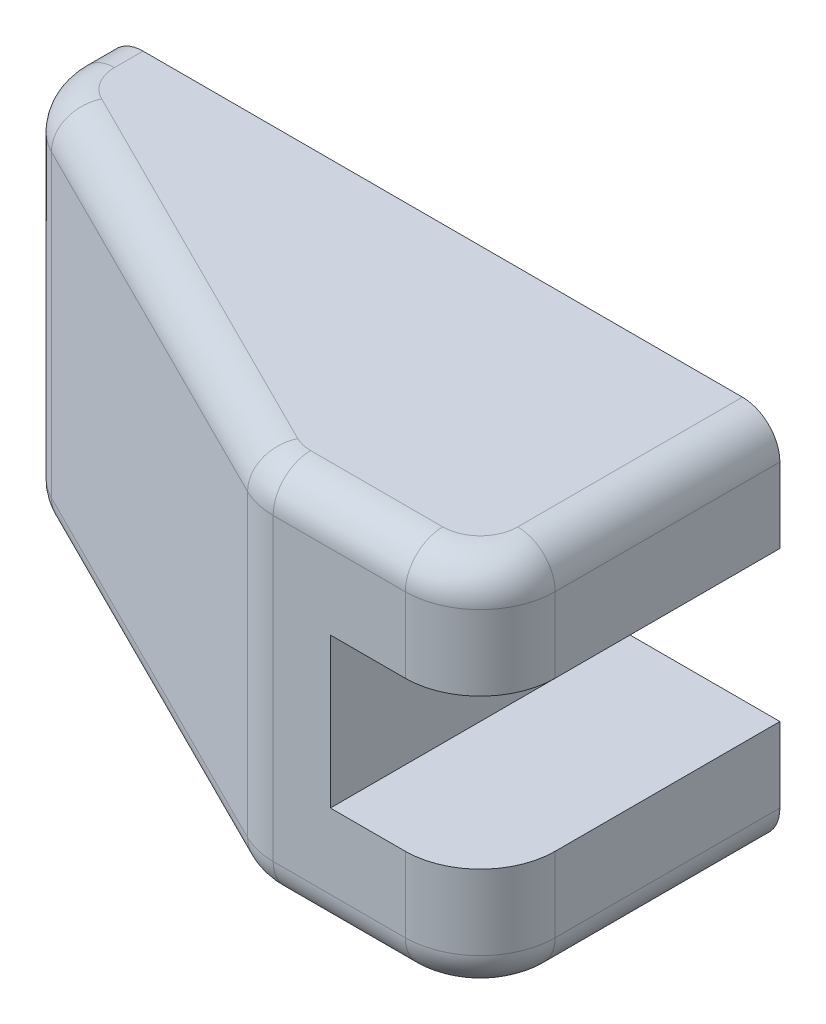
ISO-10303-21;
HEADER;
FILE_DESCRIPTION(('STEP AP214'),'2;1');
FILE_NAME('part.step','',(''),(''),'','','');
FILE_SCHEMA(('AUTOMOTIVE_DESIGN { 1 0 10303 214 1 1 1 1 }'));
ENDSEC;
DATA;
#1=APPLICATION_CONTEXT('core data for automotive mechanical design processes');
#2=APPLICATION_PROTOCOL_DEFINITION('international standard','automotive_design',2000,#1);
#3=PRODUCT_CONTEXT('',#1,'mechanical');
#4=PRODUCT('Part','Part','',(#3));
#5=PRODUCT_RELATED_PRODUCT_CATEGORY('part','',(#4));
#6=PRODUCT_DEFINITION_FORMATION('','',#4);
#7=PRODUCT_DEFINITION_CONTEXT('part definition',#1,'design');
#8=PRODUCT_DEFINITION('design','',#6,#7);
#9=PRODUCT_DEFINITION_SHAPE('','',#8);
#10=(LENGTH_UNIT() NAMED_UNIT(*) SI_UNIT(.MILLI.,.METRE.));
#11=(NAMED_UNIT(*) PLANE_ANGLE_UNIT() SI_UNIT($,.RADIAN.));
#12=(NAMED_UNIT(*) SI_UNIT($,.STERADIAN.) SOLID_ANGLE_UNIT());
#13=UNCERTAINTY_MEASURE_WITH_UNIT(LENGTH_MEASURE(1.E-05),#10,'distance_accuracy_value','');
#14=(GEOMETRIC_REPRESENTATION_CONTEXT(3) GLOBAL_UNCERTAINTY_ASSIGNED_CONTEXT((#13)) GLOBAL_UNIT_ASSIGNED_CONTEXT((#10,
#11,#12)) REPRESENTATION_CONTEXT('',''));
#15=CARTESIAN_POINT('',(0.,0.,0.));
#16=DIRECTION('',(0.,0.,1.));
#17=DIRECTION('',(1.,0.,0.));
#18=AXIS2_PLACEMENT_3D('',#15,#16,#17);
#19=CARTESIAN_POINT('',(-652.,0.,40.));
#20=DIRECTION('',(-1.,0.,0.));
#21=DIRECTION('',(0.,0.,-1.));
#22=AXIS2_PLACEMENT_3D('',#19,#20,#21);
#23=PLANE('',#22);
#24=DIRECTION('',(0.,-1.,0.));
#25=VECTOR('',#24,1.);
#26=CARTESIAN_POINT('',(-652.,0.,0.));
#27=LINE('',#26,#25);
#28=CARTESIAN_POINT('',(-652.,420.,0.));
#29=VERTEX_POINT('',#28);
#30=CARTESIAN_POINT('',(-652.,380.,0.));
#31=VERTEX_POINT('',#30);
#32=EDGE_CURVE('E214',#29,#31,#27,.T.);
#33=ORIENTED_EDGE('',*,*,#32,.T.);
#34=DIRECTION('',(0.,0.,-1.));
#35=VECTOR('',#34,1.);
#36=CARTESIAN_POINT('',(-652.,380.,3.81966011250102));
#37=LINE('',#36,#35);
#38=CARTESIAN_POINT('',(-652.,380.,3.81966011250102));
#39=VERTEX_POINT('',#38);
#40=EDGE_CURVE('E299',#31,#39,#37,.F.);
#41=ORIENTED_EDGE('',*,*,#40,.T.);
#42=DIRECTION('',(0.,1.,0.));
#43=VECTOR('',#42,1.);
#44=CARTESIAN_POINT('',(-652.,0.,3.81966011250102));
#45=LINE('',#44,#43);
#46=CARTESIAN_POINT('',(-652.,420.,3.81966011250102));
#47=VERTEX_POINT('',#46);
#48=EDGE_CURVE('E249',#39,#47,#45,.T.);
#49=ORIENTED_EDGE('',*,*,#48,.T.);
#50=DIRECTION('',(0.,0.,-1.));
#51=VECTOR('',#50,1.);
#52=CARTESIAN_POINT('',(-652.,420.,40.));
#53=LINE('',#52,#51);
#54=EDGE_CURVE('E296',#47,#29,#53,.T.);
#55=ORIENTED_EDGE('',*,*,#54,.T.);
#56=EDGE_LOOP('',(#33,#41,#49,#55));
#57=FACE_BOUND('',#56,.T.);
#58=ADVANCED_FACE('F38',(#57),#23,.T.);
#59=CARTESIAN_POINT('',(0.,425.,40.));
#60=DIRECTION('',(0.,1.,0.));
#61=DIRECTION('',(0.,0.,-1.));
#62=AXIS2_PLACEMENT_3D('',#59,#60,#61);
#63=PLANE('',#62);
#64=DIRECTION('',(-1.,0.,0.));
#65=VECTOR('',#64,1.);
#66=CARTESIAN_POINT('',(0.,425.,0.));
#67=LINE('',#66,#65);
#68=CARTESIAN_POINT('',(-567.,425.,0.));
#69=VERTEX_POINT('',#68);
#70=CARTESIAN_POINT('',(-647.,425.,0.));
#71=VERTEX_POINT('',#70);
#72=EDGE_CURVE('E195',#69,#71,#67,.T.);
#73=ORIENTED_EDGE('',*,*,#72,.T.);
#74=DIRECTION('',(0.,0.,-1.));
#75=VECTOR('',#74,1.);
#76=CARTESIAN_POINT('',(-647.,425.,40.));
#77=LINE('',#76,#75);
#78=CARTESIAN_POINT('',(-647.,425.,3.81966011250102));
#79=VERTEX_POINT('',#78);
#80=EDGE_CURVE('E63',#71,#79,#77,.F.);
#81=ORIENTED_EDGE('',*,*,#80,.T.);
#82=CARTESIAN_POINT('',(-642.,425.,3.81966011250102));
#83=DIRECTION('',(0.,1.,0.));
#84=DIRECTION('',(0.,0.,1.));
#85=AXIS2_PLACEMENT_3D('',#82,#83,#84);
#86=CIRCLE('',#85,5.);
#87=CARTESIAN_POINT('',(-644.2360679775,425.,8.2917960675006));
#88=VERTEX_POINT('',#87);
#89=EDGE_CURVE('E315',#79,#88,#86,.T.);
#90=ORIENTED_EDGE('',*,*,#89,.T.);
#91=DIRECTION('',(0.894427190999917,0.,0.447213595499956));
#92=VECTOR('',#91,1.);
#93=CARTESIAN_POINT('',(-116.163932022499,425.,272.327864045));
#94=LINE('',#93,#92);
#95=CARTESIAN_POINT('',(-591.875388202502,425.,34.4721359549996));
#96=VERTEX_POINT('',#95);
#97=EDGE_CURVE('E305',#88,#96,#94,.T.);
#98=ORIENTED_EDGE('',*,*,#97,.T.);
#99=CARTESIAN_POINT('',(-589.639320225002,425.,30.));
#100=DIRECTION('',(0.,1.,0.));
#101=DIRECTION('',(0.,0.,1.));
#102=AXIS2_PLACEMENT_3D('',#99,#100,#101);
#103=CIRCLE('',#102,5.);
#104=CARTESIAN_POINT('',(-589.639320225002,425.,35.));
#105=VERTEX_POINT('',#104);
#106=EDGE_CURVE('E307',#96,#105,#103,.T.);
#107=ORIENTED_EDGE('',*,*,#106,.T.);
#108=DIRECTION('',(-1.,0.,0.));
#109=VECTOR('',#108,1.);
#110=CARTESIAN_POINT('',(-572.,425.,35.));
#111=LINE('',#110,#109);
#112=CARTESIAN_POINT('',(-572.,425.,35.));
#113=VERTEX_POINT('',#112);
#114=EDGE_CURVE('E309',#105,#113,#111,.F.);
#115=ORIENTED_EDGE('',*,*,#114,.T.);
#116=CARTESIAN_POINT('',(-572.,425.,30.));
#117=DIRECTION('',(0.,1.,0.));
#118=DIRECTION('',(0.,0.,1.));
#119=AXIS2_PLACEMENT_3D('',#116,#117,#118);
#120=CIRCLE('',#119,5.);
#121=CARTESIAN_POINT('',(-567.,425.,30.));
#122=VERTEX_POINT('',#121);
#123=EDGE_CURVE('E311',#113,#122,#120,.T.);
#124=ORIENTED_EDGE('',*,*,#123,.T.);
#125=DIRECTION('',(0.,0.,-1.));
#126=VECTOR('',#125,1.);
#127=CARTESIAN_POINT('',(-567.,425.,40.));
#128=LINE('',#127,#126);
#129=EDGE_CURVE('E313',#122,#69,#128,.T.);
#130=ORIENTED_EDGE('',*,*,#129,.T.);
#131=EDGE_LOOP('',(#73,#81,#90,#98,#107,#115,#124,#130));
#132=FACE_BOUND('',#131,.T.);
#133=ADVANCED_FACE('F366',(#132),#63,.T.);
#134=CARTESIAN_POINT('',(-562.,0.,40.));
#135=DIRECTION('',(1.,0.,0.));
#136=DIRECTION('',(0.,0.,1.));
#137=AXIS2_PLACEMENT_3D('',#134,#135,#136);
#138=PLANE('',#137);
#139=DIRECTION('',(0.,1.,0.));
#140=VECTOR('',#139,1.);
#141=CARTESIAN_POINT('',(-562.,0.,0.));
#142=LINE('',#141,#140);
#143=CARTESIAN_POINT('',(-562.,410.,0.));
#144=VERTEX_POINT('',#143);
#145=CARTESIAN_POINT('',(-562.,420.,0.));
#146=VERTEX_POINT('',#145);
#147=EDGE_CURVE('E230',#144,#146,#142,.T.);
#148=ORIENTED_EDGE('',*,*,#147,.T.);
#149=DIRECTION('',(0.,0.,-1.));
#150=VECTOR('',#149,1.);
#151=CARTESIAN_POINT('',(-562.,420.,40.));
#152=LINE('',#151,#150);
#153=CARTESIAN_POINT('',(-562.,420.,30.));
#154=VERTEX_POINT('',#153);
#155=EDGE_CURVE('E55',#146,#154,#152,.F.);
#156=ORIENTED_EDGE('',*,*,#155,.T.);
#157=DIRECTION('',(0.,1.,0.));
#158=VECTOR('',#157,1.);
#159=CARTESIAN_POINT('',(-562.,410.,30.));
#160=LINE('',#159,#158);
#161=CARTESIAN_POINT('',(-562.,410.,30.));
#162=VERTEX_POINT('',#161);
#163=EDGE_CURVE('E257',#154,#162,#160,.F.);
#164=ORIENTED_EDGE('',*,*,#163,.T.);
#165=DIRECTION('',(0.,0.,-1.));
#166=VECTOR('',#165,1.);
#167=CARTESIAN_POINT('',(-562.,410.,40.));
#168=LINE('',#167,#166);
#169=EDGE_CURVE('E233',#162,#144,#168,.T.);
#170=ORIENTED_EDGE('',*,*,#169,.T.);
#171=EDGE_LOOP('',(#148,#156,#164,#170));
#172=FACE_BOUND('',#171,.T.);
#173=ADVANCED_FACE('F428',(#172),#138,.T.);
#174=CARTESIAN_POINT('',(0.,410.,40.));
#175=DIRECTION('',(0.,-1.,0.));
#176=DIRECTION('',(0.,0.,1.));
#177=AXIS2_PLACEMENT_3D('',#174,#175,#176);
#178=PLANE('',#177);
#179=ORIENTED_EDGE('',*,*,#169,.F.);
#180=CARTESIAN_POINT('',(-572.,410.,30.));
#181=DIRECTION('',(0.,-1.,0.));
#182=DIRECTION('',(0.,0.,-1.));
#183=AXIS2_PLACEMENT_3D('',#180,#181,#182);
#184=CIRCLE('',#183,10.);
#185=CARTESIAN_POINT('',(-572.,410.,40.));
#186=VERTEX_POINT('',#185);
#187=EDGE_CURVE('E259',#162,#186,#184,.T.);
#188=ORIENTED_EDGE('',*,*,#187,.T.);
#189=DIRECTION('',(1.,0.,0.));
#190=VECTOR('',#189,1.);
#191=CARTESIAN_POINT('',(0.,410.,40.));
#192=LINE('',#191,#190);
#193=CARTESIAN_POINT('',(-582.,410.,40.));
#194=VERTEX_POINT('',#193);
#195=EDGE_CURVE('E210',#194,#186,#192,.T.);
#196=ORIENTED_EDGE('',*,*,#195,.F.);
#197=DIRECTION('',(0.,0.,-1.));
#198=VECTOR('',#197,1.);
#199=CARTESIAN_POINT('',(-582.,410.,40.));
#200=LINE('',#199,#198);
#201=CARTESIAN_POINT('',(-582.,410.,0.));
#202=VERTEX_POINT('',#201);
#203=EDGE_CURVE('E204',#194,#202,#200,.T.);
#204=ORIENTED_EDGE('',*,*,#203,.T.);
#205=DIRECTION('',(1.,0.,0.));
#206=VECTOR('',#205,1.);
#207=CARTESIAN_POINT('',(0.,410.,0.));
#208=LINE('',#207,#206);
#209=EDGE_CURVE('E227',#202,#144,#208,.T.);
#210=ORIENTED_EDGE('',*,*,#209,.T.);
#211=EDGE_LOOP('',(#179,#188,#196,#204,#210));
#212=FACE_BOUND('',#211,.T.);
#213=ADVANCED_FACE('F424',(#212),#178,.T.);
#214=CARTESIAN_POINT('',(-582.,0.,40.));
#215=DIRECTION('',(1.,0.,0.));
#216=DIRECTION('',(0.,0.,1.));
#217=AXIS2_PLACEMENT_3D('',#214,#215,#216);
#218=PLANE('',#217);
#219=DIRECTION('',(0.,1.,0.));
#220=VECTOR('',#219,1.);
#221=CARTESIAN_POINT('',(-582.,0.,0.));
#222=LINE('',#221,#220);
#223=CARTESIAN_POINT('',(-582.,390.,0.));
#224=VERTEX_POINT('',#223);
#225=EDGE_CURVE('E225',#224,#202,#222,.T.);
#226=ORIENTED_EDGE('',*,*,#225,.T.);
#227=ORIENTED_EDGE('',*,*,#203,.F.);
#228=DIRECTION('',(0.,1.,0.));
#229=VECTOR('',#228,1.);
#230=CARTESIAN_POINT('',(-582.,0.,40.));
#231=LINE('',#230,#229);
#232=CARTESIAN_POINT('',(-582.,390.,40.));
#233=VERTEX_POINT('',#232);
#234=EDGE_CURVE('E189',#233,#194,#231,.T.);
#235=ORIENTED_EDGE('',*,*,#234,.F.);
#236=DIRECTION('',(0.,0.,-1.));
#237=VECTOR('',#236,1.);
#238=CARTESIAN_POINT('',(-582.,390.,40.));
#239=LINE('',#238,#237);
#240=EDGE_CURVE('E198',#233,#224,#239,.T.);
#241=ORIENTED_EDGE('',*,*,#240,.T.);
#242=EDGE_LOOP('',(#226,#227,#235,#241));
#243=FACE_BOUND('',#242,.T.);
#244=ADVANCED_FACE('F207',(#243),#218,.T.);
#245=CARTESIAN_POINT('',(0.,390.,40.));
#246=DIRECTION('',(0.,-1.,0.));
#247=DIRECTION('',(0.,0.,1.));
#248=AXIS2_PLACEMENT_3D('',#245,#246,#247);
#249=PLANE('',#248);
#250=DIRECTION('',(1.,0.,0.));
#251=VECTOR('',#250,1.);
#252=CARTESIAN_POINT('',(0.,390.,40.));
#253=LINE('',#252,#251);
#254=CARTESIAN_POINT('',(-572.,390.,40.));
#255=VERTEX_POINT('',#254);
#256=EDGE_CURVE('E183',#233,#255,#253,.T.);
#257=ORIENTED_EDGE('',*,*,#256,.T.);
#258=CARTESIAN_POINT('',(-572.,390.,30.));
#259=DIRECTION('',(0.,-1.,0.));
#260=DIRECTION('',(0.,0.,-1.));
#261=AXIS2_PLACEMENT_3D('',#258,#259,#260);
#262=CIRCLE('',#261,10.);
#263=CARTESIAN_POINT('',(-562.,390.,30.));
#264=VERTEX_POINT('',#263);
#265=EDGE_CURVE('E255',#255,#264,#262,.F.);
#266=ORIENTED_EDGE('',*,*,#265,.T.);
#267=DIRECTION('',(0.,0.,-1.));
#268=VECTOR('',#267,1.);
#269=CARTESIAN_POINT('',(-562.,390.,40.));
#270=LINE('',#269,#268);
#271=CARTESIAN_POINT('',(-562.,390.,0.));
#272=VERTEX_POINT('',#271);
#273=EDGE_CURVE('E205',#264,#272,#270,.T.);
#274=ORIENTED_EDGE('',*,*,#273,.T.);
#275=DIRECTION('',(1.,0.,0.));
#276=VECTOR('',#275,1.);
#277=CARTESIAN_POINT('',(0.,390.,0.));
#278=LINE('',#277,#276);
#279=EDGE_CURVE('E201',#224,#272,#278,.T.);
#280=ORIENTED_EDGE('',*,*,#279,.F.);
#281=ORIENTED_EDGE('',*,*,#240,.F.);
#282=EDGE_LOOP('',(#257,#266,#274,#280,#281));
#283=FACE_BOUND('',#282,.T.);
#284=ADVANCED_FACE('F199',(#283),#249,.F.);
#285=CARTESIAN_POINT('',(-562.,0.,40.));
#286=DIRECTION('',(-1.,0.,0.));
#287=DIRECTION('',(0.,0.,-1.));
#288=AXIS2_PLACEMENT_3D('',#285,#286,#287);
#289=PLANE('',#288);
#290=DIRECTION('',(0.,-1.,0.));
#291=VECTOR('',#290,1.);
#292=CARTESIAN_POINT('',(-562.,0.,30.));
#293=LINE('',#292,#291);
#294=CARTESIAN_POINT('',(-562.,380.,30.));
#295=VERTEX_POINT('',#294);
#296=EDGE_CURVE('E252',#264,#295,#293,.T.);
#297=ORIENTED_EDGE('',*,*,#296,.T.);
#298=DIRECTION('',(0.,0.,-1.));
#299=VECTOR('',#298,1.);
#300=CARTESIAN_POINT('',(-562.,380.,40.));
#301=LINE('',#300,#299);
#302=CARTESIAN_POINT('',(-562.,380.,0.));
#303=VERTEX_POINT('',#302);
#304=EDGE_CURVE('E261',#295,#303,#301,.T.);
#305=ORIENTED_EDGE('',*,*,#304,.T.);
#306=DIRECTION('',(0.,-1.,0.));
#307=VECTOR('',#306,1.);
#308=CARTESIAN_POINT('',(-562.,0.,0.));
#309=LINE('',#308,#307);
#310=EDGE_CURVE('E221',#272,#303,#309,.T.);
#311=ORIENTED_EDGE('',*,*,#310,.F.);
#312=ORIENTED_EDGE('',*,*,#273,.F.);
#313=EDGE_LOOP('',(#297,#305,#311,#312));
#314=FACE_BOUND('',#313,.T.);
#315=ADVANCED_FACE('F418',(#314),#289,.F.);
#316=CARTESIAN_POINT('',(0.,375.,40.));
#317=DIRECTION('',(0.,1.,0.));
#318=DIRECTION('',(0.,0.,-1.));
#319=AXIS2_PLACEMENT_3D('',#316,#317,#318);
#320=PLANE('',#319);
#321=DIRECTION('',(-1.,0.,0.));
#322=VECTOR('',#321,1.);
#323=CARTESIAN_POINT('',(0.,375.,0.));
#324=LINE('',#323,#322);
#325=CARTESIAN_POINT('',(-567.,375.,0.));
#326=VERTEX_POINT('',#325);
#327=CARTESIAN_POINT('',(-647.,375.,0.));
#328=VERTEX_POINT('',#327);
#329=EDGE_CURVE('E217',#326,#328,#324,.T.);
#330=ORIENTED_EDGE('',*,*,#329,.F.);
#331=DIRECTION('',(0.,0.,-1.));
#332=VECTOR('',#331,1.);
#333=CARTESIAN_POINT('',(-567.,375.,40.));
#334=LINE('',#333,#332);
#335=CARTESIAN_POINT('',(-567.,375.,30.));
#336=VERTEX_POINT('',#335);
#337=EDGE_CURVE('E284',#326,#336,#334,.F.);
#338=ORIENTED_EDGE('',*,*,#337,.T.);
#339=CARTESIAN_POINT('',(-572.,375.,30.));
#340=DIRECTION('',(0.,1.,0.));
#341=DIRECTION('',(0.,0.,1.));
#342=AXIS2_PLACEMENT_3D('',#339,#340,#341);
#343=CIRCLE('',#342,5.);
#344=CARTESIAN_POINT('',(-572.,375.,35.));
#345=VERTEX_POINT('',#344);
#346=EDGE_CURVE('E282',#336,#345,#343,.F.);
#347=ORIENTED_EDGE('',*,*,#346,.T.);
#348=DIRECTION('',(-1.,0.,0.));
#349=VECTOR('',#348,1.);
#350=CARTESIAN_POINT('',(0.,375.,35.));
#351=LINE('',#350,#349);
#352=CARTESIAN_POINT('',(-589.639320225002,375.,35.));
#353=VERTEX_POINT('',#352);
#354=EDGE_CURVE('E280',#345,#353,#351,.T.);
#355=ORIENTED_EDGE('',*,*,#354,.T.);
#356=CARTESIAN_POINT('',(-589.639320225002,375.,30.));
#357=DIRECTION('',(0.,1.,0.));
#358=DIRECTION('',(0.,0.,1.));
#359=AXIS2_PLACEMENT_3D('',#356,#357,#358);
#360=CIRCLE('',#359,5.);
#361=CARTESIAN_POINT('',(-591.875388202502,375.,34.4721359549996));
#362=VERTEX_POINT('',#361);
#363=EDGE_CURVE('E278',#353,#362,#360,.F.);
#364=ORIENTED_EDGE('',*,*,#363,.T.);
#365=DIRECTION('',(-0.894427190999917,0.,-0.447213595499956));
#366=VECTOR('',#365,1.);
#367=CARTESIAN_POINT('',(-644.2360679775,375.,8.29179606750052));
#368=LINE('',#367,#366);
#369=CARTESIAN_POINT('',(-644.2360679775,375.,8.29179606750059));
#370=VERTEX_POINT('',#369);
#371=EDGE_CURVE('E272',#362,#370,#368,.T.);
#372=ORIENTED_EDGE('',*,*,#371,.T.);
#373=CARTESIAN_POINT('',(-642.,375.,3.81966011250102));
#374=DIRECTION('',(0.,1.,0.));
#375=DIRECTION('',(0.,0.,1.));
#376=AXIS2_PLACEMENT_3D('',#373,#374,#375);
#377=CIRCLE('',#376,5.);
#378=CARTESIAN_POINT('',(-647.,375.,3.81966011250102));
#379=VERTEX_POINT('',#378);
#380=EDGE_CURVE('E274',#370,#379,#377,.F.);
#381=ORIENTED_EDGE('',*,*,#380,.T.);
#382=DIRECTION('',(0.,0.,-1.));
#383=VECTOR('',#382,1.);
#384=CARTESIAN_POINT('',(-647.,375.,0.));
#385=LINE('',#384,#383);
#386=EDGE_CURVE('E276',#379,#328,#385,.T.);
#387=ORIENTED_EDGE('',*,*,#386,.T.);
#388=EDGE_LOOP('',(#330,#338,#347,#355,#364,#372,#381,#387));
#389=FACE_BOUND('',#388,.T.);
#390=ADVANCED_FACE('F443',(#389),#320,.F.);
#391=CARTESIAN_POINT('',(0.,0.,40.));
#392=DIRECTION('',(0.,0.,-1.));
#393=DIRECTION('',(1.,0.,0.));
#394=AXIS2_PLACEMENT_3D('',#391,#392,#393);
#395=PLANE('',#394);
#396=DIRECTION('',(0.,-1.,0.));
#397=VECTOR('',#396,1.);
#398=CARTESIAN_POINT('',(-589.639320225002,375.,40.));
#399=LINE('',#398,#397);
#400=CARTESIAN_POINT('',(-589.639320225002,420.,40.));
#401=VERTEX_POINT('',#400);
#402=CARTESIAN_POINT('',(-589.639320225002,380.,40.));
#403=VERTEX_POINT('',#402);
#404=EDGE_CURVE('E241',#401,#403,#399,.T.);
#405=ORIENTED_EDGE('',*,*,#404,.T.);
#406=DIRECTION('',(-1.,0.,0.));
#407=VECTOR('',#406,1.);
#408=CARTESIAN_POINT('',(0.,380.,40.));
#409=LINE('',#408,#407);
#410=CARTESIAN_POINT('',(-572.,380.,40.));
#411=VERTEX_POINT('',#410);
#412=EDGE_CURVE('E290',#403,#411,#409,.F.);
#413=ORIENTED_EDGE('',*,*,#412,.T.);
#414=DIRECTION('',(0.,-1.,0.));
#415=VECTOR('',#414,1.);
#416=CARTESIAN_POINT('',(-572.,0.,40.));
#417=LINE('',#416,#415);
#418=EDGE_CURVE('E192',#411,#255,#417,.F.);
#419=ORIENTED_EDGE('',*,*,#418,.T.);
#420=ORIENTED_EDGE('',*,*,#256,.F.);
#421=ORIENTED_EDGE('',*,*,#234,.T.);
#422=ORIENTED_EDGE('',*,*,#195,.T.);
#423=DIRECTION('',(0.,1.,0.));
#424=VECTOR('',#423,1.);
#425=CARTESIAN_POINT('',(-572.,425.,40.));
#426=LINE('',#425,#424);
#427=CARTESIAN_POINT('',(-572.,420.,40.));
#428=VERTEX_POINT('',#427);
#429=EDGE_CURVE('E235',#186,#428,#426,.T.);
#430=ORIENTED_EDGE('',*,*,#429,.T.);
#431=DIRECTION('',(-1.,0.,0.));
#432=VECTOR('',#431,1.);
#433=CARTESIAN_POINT('',(-589.639320225002,420.,40.));
#434=LINE('',#433,#432);
#435=EDGE_CURVE('E288',#428,#401,#434,.T.);
#436=ORIENTED_EDGE('',*,*,#435,.T.);
#437=EDGE_LOOP('',(#405,#413,#419,#420,#421,#422,#430,#436));
#438=FACE_BOUND('',#437,.T.);
#439=ADVANCED_FACE('F186',(#438),#395,.F.);
#440=CARTESIAN_POINT('',(0.,0.,0.));
#441=DIRECTION('',(0.,0.,-1.));
#442=DIRECTION('',(1.,0.,0.));
#443=AXIS2_PLACEMENT_3D('',#440,#441,#442);
#444=PLANE('',#443);
#445=ORIENTED_EDGE('',*,*,#310,.T.);
#446=CARTESIAN_POINT('',(-567.,380.,0.));
#447=DIRECTION('',(0.,0.,-1.));
#448=DIRECTION('',(-1.,0.,0.));
#449=AXIS2_PLACEMENT_3D('',#446,#447,#448);
#450=CIRCLE('',#449,5.);
#451=EDGE_CURVE('E270',#303,#326,#450,.T.);
#452=ORIENTED_EDGE('',*,*,#451,.T.);
#453=ORIENTED_EDGE('',*,*,#329,.T.);
#454=CARTESIAN_POINT('',(-647.,380.,0.));
#455=DIRECTION('',(0.,0.,-1.));
#456=DIRECTION('',(-1.,0.,0.));
#457=AXIS2_PLACEMENT_3D('',#454,#455,#456);
#458=CIRCLE('',#457,5.);
#459=EDGE_CURVE('E268',#328,#31,#458,.T.);
#460=ORIENTED_EDGE('',*,*,#459,.T.);
#461=ORIENTED_EDGE('',*,*,#32,.F.);
#462=CARTESIAN_POINT('',(-647.,420.,0.));
#463=DIRECTION('',(0.,0.,-1.));
#464=DIRECTION('',(-1.,0.,0.));
#465=AXIS2_PLACEMENT_3D('',#462,#463,#464);
#466=CIRCLE('',#465,5.);
#467=EDGE_CURVE('E266',#29,#71,#466,.T.);
#468=ORIENTED_EDGE('',*,*,#467,.T.);
#469=ORIENTED_EDGE('',*,*,#72,.F.);
#470=CARTESIAN_POINT('',(-567.,420.,0.));
#471=DIRECTION('',(0.,0.,-1.));
#472=DIRECTION('',(-1.,0.,0.));
#473=AXIS2_PLACEMENT_3D('',#470,#471,#472);
#474=CIRCLE('',#473,5.);
#475=EDGE_CURVE('E264',#69,#146,#474,.T.);
#476=ORIENTED_EDGE('',*,*,#475,.T.);
#477=ORIENTED_EDGE('',*,*,#147,.F.);
#478=ORIENTED_EDGE('',*,*,#209,.F.);
#479=ORIENTED_EDGE('',*,*,#225,.F.);
#480=ORIENTED_EDGE('',*,*,#279,.T.);
#481=EDGE_LOOP('',(#445,#452,#453,#460,#461,#468,#469,#476,#477,#478,#479,#480));
#482=FACE_BOUND('',#481,.T.);
#483=ADVANCED_FACE('F368',(#482),#444,.T.);
#484=CARTESIAN_POINT('',(-592.,0.,40.));
#485=DIRECTION('',(-0.447213595499956,0.,0.894427190999917));
#486=DIRECTION('',(0.,1.,0.));
#487=AXIS2_PLACEMENT_3D('',#484,#485,#486);
#488=PLANE('',#487);
#489=DIRECTION('',(0.,1.,0.));
#490=VECTOR('',#489,1.);
#491=CARTESIAN_POINT('',(-646.472135955,0.,12.7639320225002));
#492=LINE('',#491,#490);
#493=CARTESIAN_POINT('',(-646.472135955,420.,12.7639320225002));
#494=VERTEX_POINT('',#493);
#495=CARTESIAN_POINT('',(-646.472135955,380.,12.7639320225002));
#496=VERTEX_POINT('',#495);
#497=EDGE_CURVE('E243',#494,#496,#492,.F.);
#498=ORIENTED_EDGE('',*,*,#497,.T.);
#499=DIRECTION('',(-0.894427190999917,0.,-0.447213595499956));
#500=VECTOR('',#499,1.);
#501=CARTESIAN_POINT('',(-594.111456180001,380.,38.9442719099991));
#502=LINE('',#501,#500);
#503=CARTESIAN_POINT('',(-594.111456180001,380.,38.9442719099992));
#504=VERTEX_POINT('',#503);
#505=EDGE_CURVE('E11',#496,#504,#502,.F.);
#506=ORIENTED_EDGE('',*,*,#505,.T.);
#507=DIRECTION('',(0.,-1.,0.));
#508=VECTOR('',#507,1.);
#509=CARTESIAN_POINT('',(-594.111456180001,425.,38.9442719099992));
#510=LINE('',#509,#508);
#511=CARTESIAN_POINT('',(-594.111456180001,420.,38.9442719099992));
#512=VERTEX_POINT('',#511);
#513=EDGE_CURVE('E246',#504,#512,#510,.F.);
#514=ORIENTED_EDGE('',*,*,#513,.T.);
#515=DIRECTION('',(0.894427190999917,0.,0.447213595499956));
#516=VECTOR('',#515,1.);
#517=CARTESIAN_POINT('',(-592.,420.,40.));
#518=LINE('',#517,#516);
#519=EDGE_CURVE('E47',#512,#494,#518,.F.);
#520=ORIENTED_EDGE('',*,*,#519,.T.);
#521=EDGE_LOOP('',(#498,#506,#514,#520));
#522=FACE_BOUND('',#521,.T.);
#523=ADVANCED_FACE('F446',(#522),#488,.T.);
#524=CARTESIAN_POINT('',(-589.639320225002,0.,30.));
#525=DIRECTION('',(0.,1.,0.));
#526=DIRECTION('',(0.,0.,1.));
#527=AXIS2_PLACEMENT_3D('',#524,#525,#526);
#528=CYLINDRICAL_SURFACE('',#527,10.);
#529=ORIENTED_EDGE('',*,*,#513,.F.);
#530=CARTESIAN_POINT('',(-589.639320225002,380.,30.));
#531=DIRECTION('',(0.,1.,0.));
#532=DIRECTION('',(0.,0.,1.));
#533=AXIS2_PLACEMENT_3D('',#530,#531,#532);
#534=CIRCLE('',#533,10.);
#535=EDGE_CURVE('E294',#504,#403,#534,.T.);
#536=ORIENTED_EDGE('',*,*,#535,.T.);
#537=ORIENTED_EDGE('',*,*,#404,.F.);
#538=CARTESIAN_POINT('',(-589.639320225002,420.,30.));
#539=DIRECTION('',(0.,1.,0.));
#540=DIRECTION('',(0.,0.,1.));
#541=AXIS2_PLACEMENT_3D('',#538,#539,#540);
#542=CIRCLE('',#541,10.);
#543=EDGE_CURVE('E292',#401,#512,#542,.F.);
#544=ORIENTED_EDGE('',*,*,#543,.T.);
#545=EDGE_LOOP('',(#529,#536,#537,#544));
#546=FACE_BOUND('',#545,.T.);
#547=ADVANCED_FACE('F400',(#546),#528,.T.);
#548=CARTESIAN_POINT('',(-642.,0.,3.81966011250102));
#549=DIRECTION('',(0.,1.,0.));
#550=DIRECTION('',(0.,0.,1.));
#551=AXIS2_PLACEMENT_3D('',#548,#549,#550);
#552=CYLINDRICAL_SURFACE('',#551,10.);
#553=ORIENTED_EDGE('',*,*,#48,.F.);
#554=CARTESIAN_POINT('',(-642.,380.,3.81966011250102));
#555=DIRECTION('',(0.,1.,0.));
#556=DIRECTION('',(0.,0.,1.));
#557=AXIS2_PLACEMENT_3D('',#554,#555,#556);
#558=CIRCLE('',#557,10.);
#559=EDGE_CURVE('E303',#39,#496,#558,.T.);
#560=ORIENTED_EDGE('',*,*,#559,.T.);
#561=ORIENTED_EDGE('',*,*,#497,.F.);
#562=CARTESIAN_POINT('',(-642.,420.,3.81966011250102));
#563=DIRECTION('',(0.,1.,0.));
#564=DIRECTION('',(0.,0.,1.));
#565=AXIS2_PLACEMENT_3D('',#562,#563,#564);
#566=CIRCLE('',#565,10.);
#567=EDGE_CURVE('E301',#494,#47,#566,.F.);
#568=ORIENTED_EDGE('',*,*,#567,.T.);
#569=EDGE_LOOP('',(#553,#560,#561,#568));
#570=FACE_BOUND('',#569,.T.);
#571=ADVANCED_FACE('F454',(#570),#552,.T.);
#572=CARTESIAN_POINT('',(-572.,0.,30.));
#573=DIRECTION('',(0.,-1.,0.));
#574=DIRECTION('',(0.,0.,-1.));
#575=AXIS2_PLACEMENT_3D('',#572,#573,#574);
#576=CYLINDRICAL_SURFACE('',#575,10.);
#577=ORIENTED_EDGE('',*,*,#418,.F.);
#578=CARTESIAN_POINT('',(-572.,380.,30.));
#579=DIRECTION('',(0.,1.,0.));
#580=DIRECTION('',(0.,0.,1.));
#581=AXIS2_PLACEMENT_3D('',#578,#579,#580);
#582=CIRCLE('',#581,10.);
#583=EDGE_CURVE('E286',#411,#295,#582,.T.);
#584=ORIENTED_EDGE('',*,*,#583,.T.);
#585=ORIENTED_EDGE('',*,*,#296,.F.);
#586=ORIENTED_EDGE('',*,*,#265,.F.);
#587=EDGE_LOOP('',(#577,#584,#585,#586));
#588=FACE_BOUND('',#587,.T.);
#589=ADVANCED_FACE('F413',(#588),#576,.T.);
#590=CARTESIAN_POINT('',(-572.,0.,30.));
#591=DIRECTION('',(0.,-1.,0.));
#592=DIRECTION('',(0.,0.,-1.));
#593=AXIS2_PLACEMENT_3D('',#590,#591,#592);
#594=CYLINDRICAL_SURFACE('',#593,10.);
#595=ORIENTED_EDGE('',*,*,#163,.F.);
#596=CARTESIAN_POINT('',(-572.,420.,30.));
#597=DIRECTION('',(0.,1.,0.));
#598=DIRECTION('',(0.,0.,1.));
#599=AXIS2_PLACEMENT_3D('',#596,#597,#598);
#600=CIRCLE('',#599,10.);
#601=EDGE_CURVE('E319',#154,#428,#600,.F.);
#602=ORIENTED_EDGE('',*,*,#601,.T.);
#603=ORIENTED_EDGE('',*,*,#429,.F.);
#604=ORIENTED_EDGE('',*,*,#187,.F.);
#605=EDGE_LOOP('',(#595,#602,#603,#604));
#606=FACE_BOUND('',#605,.T.);
#607=ADVANCED_FACE('F427',(#606),#594,.T.);
#608=CARTESIAN_POINT('',(-647.,380.,40.));
#609=DIRECTION('',(0.,0.,1.));
#610=DIRECTION('',(1.,0.,0.));
#611=AXIS2_PLACEMENT_3D('',#608,#609,#610);
#612=CYLINDRICAL_SURFACE('',#611,5.);
#613=ORIENTED_EDGE('',*,*,#459,.F.);
#614=ORIENTED_EDGE('',*,*,#386,.F.);
#615=CARTESIAN_POINT('',(-647.,380.,3.81966011250102));
#616=DIRECTION('',(0.,0.,1.));
#617=DIRECTION('',(1.,0.,0.));
#618=AXIS2_PLACEMENT_3D('',#615,#616,#617);
#619=CIRCLE('',#618,5.);
#620=EDGE_CURVE('E218',#39,#379,#619,.T.);
#621=ORIENTED_EDGE('',*,*,#620,.F.);
#622=ORIENTED_EDGE('',*,*,#40,.F.);
#623=EDGE_LOOP('',(#613,#614,#621,#622));
#624=FACE_BOUND('',#623,.T.);
#625=ADVANCED_FACE('F461',(#624),#612,.T.);
#626=CARTESIAN_POINT('',(-642.,380.,3.81966011250102));
#627=DIRECTION('',(0.,1.,0.));
#628=DIRECTION('',(0.,0.,1.));
#629=AXIS2_PLACEMENT_3D('',#626,#627,#628);
#630=DEGENERATE_TOROIDAL_SURFACE('',#629,5.,5.,.T.);
#631=ORIENTED_EDGE('',*,*,#620,.T.);
#632=ORIENTED_EDGE('',*,*,#380,.F.);
#633=CARTESIAN_POINT('',(-644.2360679775,380.,8.29179606750061));
#634=DIRECTION('',(0.894427190999919,0.,0.447213595499951));
#635=DIRECTION('',(0.447213595499951,0.,-0.894427190999919));
#636=AXIS2_PLACEMENT_3D('',#633,#634,#635);
#637=CIRCLE('',#636,5.);
#638=EDGE_CURVE('E334',#496,#370,#637,.T.);
#639=ORIENTED_EDGE('',*,*,#638,.F.);
#640=ORIENTED_EDGE('',*,*,#559,.F.);
#641=EDGE_LOOP('',(#631,#632,#639,#640));
#642=FACE_BOUND('',#641,.T.);
#643=ADVANCED_FACE('F477',(#642),#630,.T.);
#644=CARTESIAN_POINT('',(-116.163932022499,380.,272.327864045));
#645=DIRECTION('',(0.894427190999917,0.,0.447213595499956));
#646=DIRECTION('',(0.447213595499956,0.,-0.894427190999917));
#647=AXIS2_PLACEMENT_3D('',#644,#645,#646);
#648=CYLINDRICAL_SURFACE('',#647,5.);
#649=ORIENTED_EDGE('',*,*,#638,.T.);
#650=ORIENTED_EDGE('',*,*,#371,.F.);
#651=CARTESIAN_POINT('',(-591.875388202502,380.,34.4721359549996));
#652=DIRECTION('',(0.894427190999919,0.,0.447213595499952));
#653=DIRECTION('',(0.447213595499952,0.,-0.894427190999919));
#654=AXIS2_PLACEMENT_3D('',#651,#652,#653);
#655=CIRCLE('',#654,5.);
#656=EDGE_CURVE('E331',#504,#362,#655,.T.);
#657=ORIENTED_EDGE('',*,*,#656,.F.);
#658=ORIENTED_EDGE('',*,*,#505,.F.);
#659=EDGE_LOOP('',(#649,#650,#657,#658));
#660=FACE_BOUND('',#659,.T.);
#661=ADVANCED_FACE('F474',(#660),#648,.T.);
#662=CARTESIAN_POINT('',(-589.639320225002,380.,30.));
#663=DIRECTION('',(0.,1.,0.));
#664=DIRECTION('',(0.,0.,1.));
#665=AXIS2_PLACEMENT_3D('',#662,#663,#664);
#666=DEGENERATE_TOROIDAL_SURFACE('',#665,5.,5.,.T.);
#667=ORIENTED_EDGE('',*,*,#656,.T.);
#668=ORIENTED_EDGE('',*,*,#363,.F.);
#669=CARTESIAN_POINT('',(-589.639320225002,380.,35.));
#670=DIRECTION('',(1.,0.,0.));
#671=DIRECTION('',(0.,0.,-1.));
#672=AXIS2_PLACEMENT_3D('',#669,#670,#671);
#673=CIRCLE('',#672,5.);
#674=EDGE_CURVE('E328',#403,#353,#673,.T.);
#675=ORIENTED_EDGE('',*,*,#674,.F.);
#676=ORIENTED_EDGE('',*,*,#535,.F.);
#677=EDGE_LOOP('',(#667,#668,#675,#676));
#678=FACE_BOUND('',#677,.T.);
#679=ADVANCED_FACE('F404',(#678),#666,.T.);
#680=CARTESIAN_POINT('',(0.,380.,35.));
#681=DIRECTION('',(-1.,0.,0.));
#682=DIRECTION('',(0.,0.,1.));
#683=AXIS2_PLACEMENT_3D('',#680,#681,#682);
#684=CYLINDRICAL_SURFACE('',#683,5.);
#685=ORIENTED_EDGE('',*,*,#674,.T.);
#686=ORIENTED_EDGE('',*,*,#354,.F.);
#687=CARTESIAN_POINT('',(-572.,380.,35.));
#688=DIRECTION('',(1.,0.,0.));
#689=DIRECTION('',(0.,0.,-1.));
#690=AXIS2_PLACEMENT_3D('',#687,#688,#689);
#691=CIRCLE('',#690,5.);
#692=EDGE_CURVE('E325',#411,#345,#691,.T.);
#693=ORIENTED_EDGE('',*,*,#692,.F.);
#694=ORIENTED_EDGE('',*,*,#412,.F.);
#695=EDGE_LOOP('',(#685,#686,#693,#694));
#696=FACE_BOUND('',#695,.T.);
#697=ADVANCED_FACE('F410',(#696),#684,.T.);
#698=CARTESIAN_POINT('',(-572.,380.,30.));
#699=DIRECTION('',(0.,1.,0.));
#700=DIRECTION('',(0.,0.,1.));
#701=AXIS2_PLACEMENT_3D('',#698,#699,#700);
#702=DEGENERATE_TOROIDAL_SURFACE('',#701,5.,5.,.T.);
#703=ORIENTED_EDGE('',*,*,#692,.T.);
#704=ORIENTED_EDGE('',*,*,#346,.F.);
#705=CARTESIAN_POINT('',(-567.,380.,30.));
#706=DIRECTION('',(0.,0.,-1.));
#707=DIRECTION('',(-1.,0.,0.));
#708=AXIS2_PLACEMENT_3D('',#705,#706,#707);
#709=CIRCLE('',#708,5.);
#710=EDGE_CURVE('E322',#295,#336,#709,.T.);
#711=ORIENTED_EDGE('',*,*,#710,.F.);
#712=ORIENTED_EDGE('',*,*,#583,.F.);
#713=EDGE_LOOP('',(#703,#704,#711,#712));
#714=FACE_BOUND('',#713,.T.);
#715=ADVANCED_FACE('F465',(#714),#702,.T.);
#716=CARTESIAN_POINT('',(-567.,380.,40.));
#717=DIRECTION('',(0.,0.,-1.));
#718=DIRECTION('',(-1.,0.,0.));
#719=AXIS2_PLACEMENT_3D('',#716,#717,#718);
#720=CYLINDRICAL_SURFACE('',#719,5.);
#721=ORIENTED_EDGE('',*,*,#710,.T.);
#722=ORIENTED_EDGE('',*,*,#337,.F.);
#723=ORIENTED_EDGE('',*,*,#451,.F.);
#724=ORIENTED_EDGE('',*,*,#304,.F.);
#725=EDGE_LOOP('',(#721,#722,#723,#724));
#726=FACE_BOUND('',#725,.T.);
#727=ADVANCED_FACE('F462',(#726),#720,.T.);
#728=CARTESIAN_POINT('',(-567.,420.,40.));
#729=DIRECTION('',(0.,0.,-1.));
#730=DIRECTION('',(-1.,0.,0.));
#731=AXIS2_PLACEMENT_3D('',#728,#729,#730);
#732=CYLINDRICAL_SURFACE('',#731,5.);
#733=ORIENTED_EDGE('',*,*,#475,.F.);
#734=ORIENTED_EDGE('',*,*,#129,.F.);
#735=CARTESIAN_POINT('',(-567.,420.,30.));
#736=DIRECTION('',(0.,0.,1.));
#737=DIRECTION('',(1.,0.,0.));
#738=AXIS2_PLACEMENT_3D('',#735,#736,#737);
#739=CIRCLE('',#738,5.);
#740=EDGE_CURVE('E42',#154,#122,#739,.T.);
#741=ORIENTED_EDGE('',*,*,#740,.F.);
#742=ORIENTED_EDGE('',*,*,#155,.F.);
#743=EDGE_LOOP('',(#733,#734,#741,#742));
#744=FACE_BOUND('',#743,.T.);
#745=ADVANCED_FACE('F40',(#744),#732,.T.);
#746=CARTESIAN_POINT('',(-572.,420.,30.));
#747=DIRECTION('',(0.,1.,0.));
#748=DIRECTION('',(0.,0.,1.));
#749=AXIS2_PLACEMENT_3D('',#746,#747,#748);
#750=DEGENERATE_TOROIDAL_SURFACE('',#749,5.,5.,.T.);
#751=ORIENTED_EDGE('',*,*,#740,.T.);
#752=ORIENTED_EDGE('',*,*,#123,.F.);
#753=CARTESIAN_POINT('',(-572.,420.,35.));
#754=DIRECTION('',(-1.,0.,0.));
#755=DIRECTION('',(0.,0.,1.));
#756=AXIS2_PLACEMENT_3D('',#753,#754,#755);
#757=CIRCLE('',#756,5.);
#758=EDGE_CURVE('E350',#428,#113,#757,.T.);
#759=ORIENTED_EDGE('',*,*,#758,.F.);
#760=ORIENTED_EDGE('',*,*,#601,.F.);
#761=EDGE_LOOP('',(#751,#752,#759,#760));
#762=FACE_BOUND('',#761,.T.);
#763=ADVANCED_FACE('F361',(#762),#750,.T.);
#764=CARTESIAN_POINT('',(0.,420.,35.));
#765=DIRECTION('',(1.,0.,0.));
#766=DIRECTION('',(0.,0.,-1.));
#767=AXIS2_PLACEMENT_3D('',#764,#765,#766);
#768=CYLINDRICAL_SURFACE('',#767,5.);
#769=ORIENTED_EDGE('',*,*,#758,.T.);
#770=ORIENTED_EDGE('',*,*,#114,.F.);
#771=CARTESIAN_POINT('',(-589.639320225002,420.,35.));
#772=DIRECTION('',(-1.,0.,0.));
#773=DIRECTION('',(0.,0.,1.));
#774=AXIS2_PLACEMENT_3D('',#771,#772,#773);
#775=CIRCLE('',#774,5.);
#776=EDGE_CURVE('E348',#401,#105,#775,.T.);
#777=ORIENTED_EDGE('',*,*,#776,.F.);
#778=ORIENTED_EDGE('',*,*,#435,.F.);
#779=EDGE_LOOP('',(#769,#770,#777,#778));
#780=FACE_BOUND('',#779,.T.);
#781=ADVANCED_FACE('F394',(#780),#768,.T.);
#782=CARTESIAN_POINT('',(-589.639320225002,420.,30.));
#783=DIRECTION('',(0.,1.,0.));
#784=DIRECTION('',(0.,0.,1.));
#785=AXIS2_PLACEMENT_3D('',#782,#783,#784);
#786=DEGENERATE_TOROIDAL_SURFACE('',#785,5.,5.,.T.);
#787=ORIENTED_EDGE('',*,*,#776,.T.);
#788=ORIENTED_EDGE('',*,*,#106,.F.);
#789=CARTESIAN_POINT('',(-591.875388202502,420.,34.4721359549996));
#790=DIRECTION('',(-0.894427190999918,0.,-0.447213595499954));
#791=DIRECTION('',(-0.447213595499954,0.,0.894427190999918));
#792=AXIS2_PLACEMENT_3D('',#789,#790,#791);
#793=CIRCLE('',#792,5.);
#794=EDGE_CURVE('E345',#512,#96,#793,.T.);
#795=ORIENTED_EDGE('',*,*,#794,.F.);
#796=ORIENTED_EDGE('',*,*,#543,.F.);
#797=EDGE_LOOP('',(#787,#788,#795,#796));
#798=FACE_BOUND('',#797,.T.);
#799=ADVANCED_FACE('F392',(#798),#786,.T.);
#800=CARTESIAN_POINT('',(-116.163932022499,420.,272.327864045));
#801=DIRECTION('',(0.894427190999917,0.,0.447213595499956));
#802=DIRECTION('',(0.447213595499956,0.,-0.894427190999917));
#803=AXIS2_PLACEMENT_3D('',#800,#801,#802);
#804=CYLINDRICAL_SURFACE('',#803,5.);
#805=ORIENTED_EDGE('',*,*,#794,.T.);
#806=ORIENTED_EDGE('',*,*,#97,.F.);
#807=CARTESIAN_POINT('',(-644.2360679775,420.,8.29179606750061));
#808=DIRECTION('',(-0.894427190999919,0.,-0.447213595499952));
#809=DIRECTION('',(-0.447213595499952,0.,0.894427190999919));
#810=AXIS2_PLACEMENT_3D('',#807,#808,#809);
#811=CIRCLE('',#810,5.);
#812=EDGE_CURVE('E342',#494,#88,#811,.T.);
#813=ORIENTED_EDGE('',*,*,#812,.F.);
#814=ORIENTED_EDGE('',*,*,#519,.F.);
#815=EDGE_LOOP('',(#805,#806,#813,#814));
#816=FACE_BOUND('',#815,.T.);
#817=ADVANCED_FACE('F387',(#816),#804,.T.);
#818=CARTESIAN_POINT('',(-642.,420.,3.81966011250102));
#819=DIRECTION('',(0.,1.,0.));
#820=DIRECTION('',(0.,0.,1.));
#821=AXIS2_PLACEMENT_3D('',#818,#819,#820);
#822=DEGENERATE_TOROIDAL_SURFACE('',#821,5.,5.,.T.);
#823=ORIENTED_EDGE('',*,*,#812,.T.);
#824=ORIENTED_EDGE('',*,*,#89,.F.);
#825=CARTESIAN_POINT('',(-647.,420.,3.81966011250102));
#826=DIRECTION('',(0.,0.,-1.));
#827=DIRECTION('',(-1.,0.,0.));
#828=AXIS2_PLACEMENT_3D('',#825,#826,#827);
#829=CIRCLE('',#828,5.);
#830=EDGE_CURVE('E339',#47,#79,#829,.T.);
#831=ORIENTED_EDGE('',*,*,#830,.F.);
#832=ORIENTED_EDGE('',*,*,#567,.F.);
#833=EDGE_LOOP('',(#823,#824,#831,#832));
#834=FACE_BOUND('',#833,.T.);
#835=ADVANCED_FACE('F382',(#834),#822,.T.);
#836=CARTESIAN_POINT('',(-647.,420.,40.));
#837=DIRECTION('',(0.,0.,-1.));
#838=DIRECTION('',(-1.,0.,0.));
#839=AXIS2_PLACEMENT_3D('',#836,#837,#838);
#840=CYLINDRICAL_SURFACE('',#839,5.);
#841=ORIENTED_EDGE('',*,*,#830,.T.);
#842=ORIENTED_EDGE('',*,*,#80,.F.);
#843=ORIENTED_EDGE('',*,*,#467,.F.);
#844=ORIENTED_EDGE('',*,*,#54,.F.);
#845=EDGE_LOOP('',(#841,#842,#843,#844));
#846=FACE_BOUND('',#845,.T.);
#847=ADVANCED_FACE('F373',(#846),#840,.T.);
#848=CLOSED_SHELL('',(#58,#133,#173,#213,#244,#284,#315,#390,#439,#483,#523,#547,#571,#589,#607,
#625,#643,#661,#679,#697,#715,#727,#745,#763,#781,#799,#817,#835,#847));
#849=MANIFOLD_SOLID_BREP('B2',#848);
#850=ADVANCED_BREP_SHAPE_REPRESENTATION('',(#18,#849),#14);
#851=SHAPE_DEFINITION_REPRESENTATION(#9,#850);
ENDSEC;
END-ISO-10303-21;
